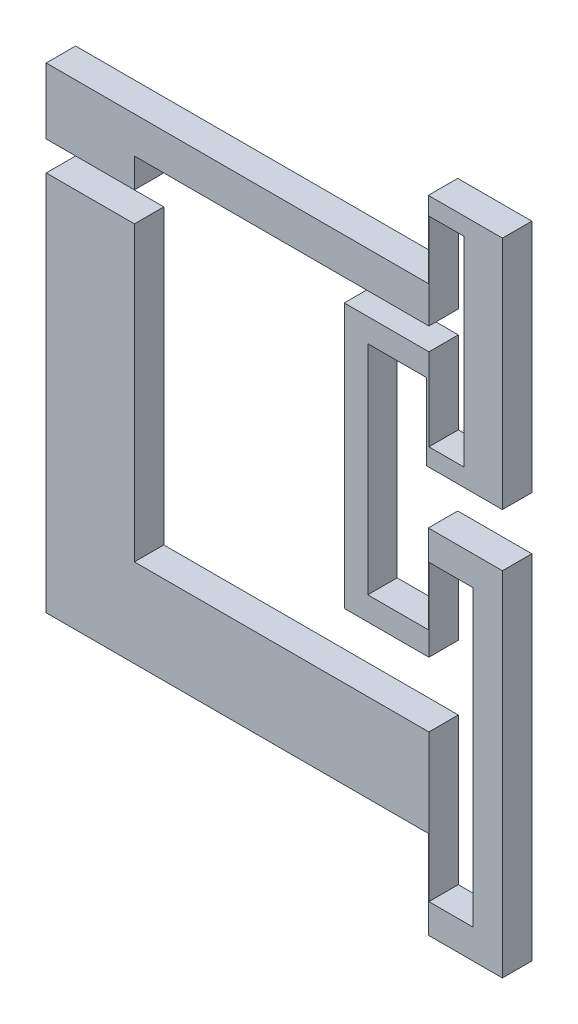
ISO-10303-21;
HEADER;
FILE_DESCRIPTION(('STEP AP214'),'2;1');
FILE_NAME('part.step','',(''),(''),'','','');
FILE_SCHEMA(('AUTOMOTIVE_DESIGN { 1 0 10303 214 1 1 1 1 }'));
ENDSEC;
DATA;
#1=APPLICATION_CONTEXT('core data for automotive mechanical design processes');
#2=APPLICATION_PROTOCOL_DEFINITION('international standard','automotive_design',2000,#1);
#3=PRODUCT_CONTEXT('',#1,'mechanical');
#4=PRODUCT('Part','Part','',(#3));
#5=PRODUCT_RELATED_PRODUCT_CATEGORY('part','',(#4));
#6=PRODUCT_DEFINITION_FORMATION('','',#4);
#7=PRODUCT_DEFINITION_CONTEXT('part definition',#1,'design');
#8=PRODUCT_DEFINITION('design','',#6,#7);
#9=PRODUCT_DEFINITION_SHAPE('','',#8);
#10=(LENGTH_UNIT() NAMED_UNIT(*) SI_UNIT(.MILLI.,.METRE.));
#11=(NAMED_UNIT(*) PLANE_ANGLE_UNIT() SI_UNIT($,.RADIAN.));
#12=(NAMED_UNIT(*) SI_UNIT($,.STERADIAN.) SOLID_ANGLE_UNIT());
#13=UNCERTAINTY_MEASURE_WITH_UNIT(LENGTH_MEASURE(1.E-05),#10,'distance_accuracy_value','');
#14=(GEOMETRIC_REPRESENTATION_CONTEXT(3) GLOBAL_UNCERTAINTY_ASSIGNED_CONTEXT((#13)) GLOBAL_UNIT_ASSIGNED_CONTEXT((#10,
#11,#12)) REPRESENTATION_CONTEXT('',''));
#15=CARTESIAN_POINT('',(0.,0.,0.));
#16=DIRECTION('',(0.,0.,1.));
#17=DIRECTION('',(1.,0.,0.));
#18=AXIS2_PLACEMENT_3D('',#15,#16,#17);
#19=CARTESIAN_POINT('',(0.,0.,5.));
#20=DIRECTION('',(0.,1.,0.));
#21=DIRECTION('',(0.,0.,1.));
#22=AXIS2_PLACEMENT_3D('',#19,#20,#21);
#23=PLANE('',#22);
#24=DIRECTION('',(1.,0.,0.));
#25=VECTOR('',#24,1.);
#26=CARTESIAN_POINT('',(0.,0.,0.));
#27=LINE('',#26,#25);
#28=CARTESIAN_POINT('',(0.,0.,0.));
#29=VERTEX_POINT('',#28);
#30=CARTESIAN_POINT('',(65.,0.,0.));
#31=VERTEX_POINT('',#30);
#32=EDGE_CURVE('E302',#29,#31,#27,.T.);
#33=ORIENTED_EDGE('',*,*,#32,.T.);
#34=DIRECTION('',(0.,0.,-1.));
#35=VECTOR('',#34,1.);
#36=CARTESIAN_POINT('',(65.,0.,5.));
#37=LINE('',#36,#35);
#38=CARTESIAN_POINT('',(65.,0.,5.));
#39=VERTEX_POINT('',#38);
#40=EDGE_CURVE('E11',#39,#31,#37,.T.);
#41=ORIENTED_EDGE('',*,*,#40,.F.);
#42=DIRECTION('',(1.,0.,0.));
#43=VECTOR('',#42,1.);
#44=CARTESIAN_POINT('',(0.,0.,5.));
#45=LINE('',#44,#43);
#46=CARTESIAN_POINT('',(0.,0.,5.));
#47=VERTEX_POINT('',#46);
#48=EDGE_CURVE('E375',#47,#39,#45,.T.);
#49=ORIENTED_EDGE('',*,*,#48,.F.);
#50=DIRECTION('',(0.,0.,-1.));
#51=VECTOR('',#50,1.);
#52=CARTESIAN_POINT('',(0.,0.,5.));
#53=LINE('',#52,#51);
#54=EDGE_CURVE('E298',#47,#29,#53,.T.);
#55=ORIENTED_EDGE('',*,*,#54,.T.);
#56=EDGE_LOOP('',(#33,#41,#49,#55));
#57=FACE_BOUND('',#56,.T.);
#58=ADVANCED_FACE('F38',(#57),#23,.F.);
#59=CARTESIAN_POINT('',(65.,-15.,5.));
#60=DIRECTION('',(1.,0.,0.));
#61=DIRECTION('',(0.,0.,-1.));
#62=AXIS2_PLACEMENT_3D('',#59,#60,#61);
#63=PLANE('',#62);
#64=DIRECTION('',(0.,-1.,0.));
#65=VECTOR('',#64,1.);
#66=CARTESIAN_POINT('',(65.,-15.,0.));
#67=LINE('',#66,#65);
#68=CARTESIAN_POINT('',(65.,-15.,0.));
#69=VERTEX_POINT('',#68);
#70=EDGE_CURVE('E305',#31,#69,#67,.T.);
#71=ORIENTED_EDGE('',*,*,#70,.T.);
#72=DIRECTION('',(0.,0.,-1.));
#73=VECTOR('',#72,1.);
#74=CARTESIAN_POINT('',(65.,-15.,5.));
#75=LINE('',#74,#73);
#76=CARTESIAN_POINT('',(65.,-15.,5.));
#77=VERTEX_POINT('',#76);
#78=EDGE_CURVE('E46',#77,#69,#75,.T.);
#79=ORIENTED_EDGE('',*,*,#78,.F.);
#80=DIRECTION('',(0.,-1.,0.));
#81=VECTOR('',#80,1.);
#82=CARTESIAN_POINT('',(65.,-10.,5.));
#83=LINE('',#82,#81);
#84=EDGE_CURVE('E181',#39,#77,#83,.T.);
#85=ORIENTED_EDGE('',*,*,#84,.F.);
#86=ORIENTED_EDGE('',*,*,#40,.T.);
#87=EDGE_LOOP('',(#71,#79,#85,#86));
#88=FACE_BOUND('',#87,.T.);
#89=ADVANCED_FACE('F573',(#88),#63,.F.);
#90=CARTESIAN_POINT('',(77.6,-15.,5.));
#91=DIRECTION('',(0.,1.,0.));
#92=DIRECTION('',(-1.,0.,0.));
#93=AXIS2_PLACEMENT_3D('',#90,#91,#92);
#94=PLANE('',#93);
#95=DIRECTION('',(1.,0.,0.));
#96=VECTOR('',#95,1.);
#97=CARTESIAN_POINT('',(77.6,-15.,0.));
#98=LINE('',#97,#96);
#99=CARTESIAN_POINT('',(77.6,-15.,0.));
#100=VERTEX_POINT('',#99);
#101=EDGE_CURVE('E307',#69,#100,#98,.T.);
#102=ORIENTED_EDGE('',*,*,#101,.T.);
#103=DIRECTION('',(0.,0.,-1.));
#104=VECTOR('',#103,1.);
#105=CARTESIAN_POINT('',(77.6,-15.,5.));
#106=LINE('',#105,#104);
#107=CARTESIAN_POINT('',(77.6,-15.,5.));
#108=VERTEX_POINT('',#107);
#109=EDGE_CURVE('E466',#108,#100,#106,.T.);
#110=ORIENTED_EDGE('',*,*,#109,.F.);
#111=DIRECTION('',(1.,0.,0.));
#112=VECTOR('',#111,1.);
#113=CARTESIAN_POINT('',(77.6,-15.,5.));
#114=LINE('',#113,#112);
#115=EDGE_CURVE('E474',#77,#108,#114,.T.);
#116=ORIENTED_EDGE('',*,*,#115,.F.);
#117=ORIENTED_EDGE('',*,*,#78,.T.);
#118=EDGE_LOOP('',(#102,#110,#116,#117));
#119=FACE_BOUND('',#118,.T.);
#120=ADVANCED_FACE('F472',(#119),#94,.F.);
#121=CARTESIAN_POINT('',(77.6,45.,5.));
#122=DIRECTION('',(-1.,0.,0.));
#123=DIRECTION('',(0.,-1.,0.));
#124=AXIS2_PLACEMENT_3D('',#121,#122,#123);
#125=PLANE('',#124);
#126=DIRECTION('',(0.,1.,0.));
#127=VECTOR('',#126,1.);
#128=CARTESIAN_POINT('',(77.6,45.,0.));
#129=LINE('',#128,#127);
#130=CARTESIAN_POINT('',(77.6,45.,0.));
#131=VERTEX_POINT('',#130);
#132=EDGE_CURVE('E309',#100,#131,#129,.T.);
#133=ORIENTED_EDGE('',*,*,#132,.T.);
#134=DIRECTION('',(0.,0.,-1.));
#135=VECTOR('',#134,1.);
#136=CARTESIAN_POINT('',(77.6,45.,5.));
#137=LINE('',#136,#135);
#138=CARTESIAN_POINT('',(77.6,45.,5.));
#139=VERTEX_POINT('',#138);
#140=EDGE_CURVE('E463',#139,#131,#137,.T.);
#141=ORIENTED_EDGE('',*,*,#140,.F.);
#142=DIRECTION('',(0.,1.,0.));
#143=VECTOR('',#142,1.);
#144=CARTESIAN_POINT('',(77.6,45.,5.));
#145=LINE('',#144,#143);
#146=EDGE_CURVE('E492',#108,#139,#145,.T.);
#147=ORIENTED_EDGE('',*,*,#146,.F.);
#148=ORIENTED_EDGE('',*,*,#109,.T.);
#149=EDGE_LOOP('',(#133,#141,#147,#148));
#150=FACE_BOUND('',#149,.T.);
#151=ADVANCED_FACE('F483',(#150),#125,.F.);
#152=CARTESIAN_POINT('',(77.6,45.,5.));
#153=DIRECTION('',(0.,-1.,0.));
#154=DIRECTION('',(1.,0.,0.));
#155=AXIS2_PLACEMENT_3D('',#152,#153,#154);
#156=PLANE('',#155);
#157=DIRECTION('',(-1.,0.,0.));
#158=VECTOR('',#157,1.);
#159=CARTESIAN_POINT('',(77.6,45.,0.));
#160=LINE('',#159,#158);
#161=CARTESIAN_POINT('',(65.,45.,0.));
#162=VERTEX_POINT('',#161);
#163=EDGE_CURVE('E311',#131,#162,#160,.T.);
#164=ORIENTED_EDGE('',*,*,#163,.T.);
#165=DIRECTION('',(0.,0.,-1.));
#166=VECTOR('',#165,1.);
#167=CARTESIAN_POINT('',(65.,45.,5.));
#168=LINE('',#167,#166);
#169=CARTESIAN_POINT('',(65.,45.,5.));
#170=VERTEX_POINT('',#169);
#171=EDGE_CURVE('E460',#170,#162,#168,.T.);
#172=ORIENTED_EDGE('',*,*,#171,.F.);
#173=DIRECTION('',(-1.,0.,0.));
#174=VECTOR('',#173,1.);
#175=CARTESIAN_POINT('',(77.6,45.,5.));
#176=LINE('',#175,#174);
#177=EDGE_CURVE('E489',#139,#170,#176,.T.);
#178=ORIENTED_EDGE('',*,*,#177,.F.);
#179=ORIENTED_EDGE('',*,*,#140,.T.);
#180=EDGE_LOOP('',(#164,#172,#178,#179));
#181=FACE_BOUND('',#180,.T.);
#182=ADVANCED_FACE('F487',(#181),#156,.F.);
#183=CARTESIAN_POINT('',(65.,45.,5.));
#184=DIRECTION('',(1.,0.,0.));
#185=DIRECTION('',(0.,0.,-1.));
#186=AXIS2_PLACEMENT_3D('',#183,#184,#185);
#187=PLANE('',#186);
#188=DIRECTION('',(0.,-1.,0.));
#189=VECTOR('',#188,1.);
#190=CARTESIAN_POINT('',(65.,45.,0.));
#191=LINE('',#190,#189);
#192=CARTESIAN_POINT('',(65.,30.,0.));
#193=VERTEX_POINT('',#192);
#194=EDGE_CURVE('E313',#162,#193,#191,.T.);
#195=ORIENTED_EDGE('',*,*,#194,.T.);
#196=DIRECTION('',(0.,0.,-1.));
#197=VECTOR('',#196,1.);
#198=CARTESIAN_POINT('',(65.,30.,5.));
#199=LINE('',#198,#197);
#200=CARTESIAN_POINT('',(65.,30.,5.));
#201=VERTEX_POINT('',#200);
#202=EDGE_CURVE('E457',#201,#193,#199,.T.);
#203=ORIENTED_EDGE('',*,*,#202,.F.);
#204=DIRECTION('',(0.,-1.,0.));
#205=VECTOR('',#204,1.);
#206=CARTESIAN_POINT('',(65.,45.,5.));
#207=LINE('',#206,#205);
#208=EDGE_CURVE('E491',#170,#201,#207,.T.);
#209=ORIENTED_EDGE('',*,*,#208,.F.);
#210=ORIENTED_EDGE('',*,*,#171,.T.);
#211=EDGE_LOOP('',(#195,#203,#209,#210));
#212=FACE_BOUND('',#211,.T.);
#213=ADVANCED_FACE('F586',(#212),#187,.F.);
#214=CARTESIAN_POINT('',(65.,30.,5.));
#215=DIRECTION('',(0.,-1.,0.));
#216=DIRECTION('',(0.,0.,-1.));
#217=AXIS2_PLACEMENT_3D('',#214,#215,#216);
#218=PLANE('',#217);
#219=DIRECTION('',(-1.,0.,0.));
#220=VECTOR('',#219,1.);
#221=CARTESIAN_POINT('',(65.,30.,0.));
#222=LINE('',#221,#220);
#223=CARTESIAN_POINT('',(54.7,30.,0.));
#224=VERTEX_POINT('',#223);
#225=EDGE_CURVE('E315',#193,#224,#222,.T.);
#226=ORIENTED_EDGE('',*,*,#225,.T.);
#227=DIRECTION('',(0.,0.,-1.));
#228=VECTOR('',#227,1.);
#229=CARTESIAN_POINT('',(54.7,30.,5.));
#230=LINE('',#229,#228);
#231=CARTESIAN_POINT('',(54.7,30.,5.));
#232=VERTEX_POINT('',#231);
#233=EDGE_CURVE('E454',#232,#224,#230,.T.);
#234=ORIENTED_EDGE('',*,*,#233,.F.);
#235=DIRECTION('',(-1.,0.,0.));
#236=VECTOR('',#235,1.);
#237=CARTESIAN_POINT('',(65.,30.,5.));
#238=LINE('',#237,#236);
#239=EDGE_CURVE('E494',#201,#232,#238,.T.);
#240=ORIENTED_EDGE('',*,*,#239,.F.);
#241=ORIENTED_EDGE('',*,*,#202,.T.);
#242=EDGE_LOOP('',(#226,#234,#240,#241));
#243=FACE_BOUND('',#242,.T.);
#244=ADVANCED_FACE('F589',(#243),#218,.F.);
#245=CARTESIAN_POINT('',(54.7,67.,5.));
#246=DIRECTION('',(-1.,0.,0.));
#247=DIRECTION('',(0.,-1.,0.));
#248=AXIS2_PLACEMENT_3D('',#245,#246,#247);
#249=PLANE('',#248);
#250=DIRECTION('',(0.,1.,0.));
#251=VECTOR('',#250,1.);
#252=CARTESIAN_POINT('',(54.7,67.,0.));
#253=LINE('',#252,#251);
#254=CARTESIAN_POINT('',(54.7,67.,0.));
#255=VERTEX_POINT('',#254);
#256=EDGE_CURVE('E317',#224,#255,#253,.T.);
#257=ORIENTED_EDGE('',*,*,#256,.T.);
#258=DIRECTION('',(0.,0.,-1.));
#259=VECTOR('',#258,1.);
#260=CARTESIAN_POINT('',(54.7,67.,5.));
#261=LINE('',#260,#259);
#262=CARTESIAN_POINT('',(54.7,67.,5.));
#263=VERTEX_POINT('',#262);
#264=EDGE_CURVE('E451',#263,#255,#261,.T.);
#265=ORIENTED_EDGE('',*,*,#264,.F.);
#266=DIRECTION('',(0.,1.,0.));
#267=VECTOR('',#266,1.);
#268=CARTESIAN_POINT('',(54.7,67.,5.));
#269=LINE('',#268,#267);
#270=EDGE_CURVE('E500',#232,#263,#269,.T.);
#271=ORIENTED_EDGE('',*,*,#270,.F.);
#272=ORIENTED_EDGE('',*,*,#233,.T.);
#273=EDGE_LOOP('',(#257,#265,#271,#272));
#274=FACE_BOUND('',#273,.T.);
#275=ADVANCED_FACE('F593',(#274),#249,.F.);
#276=CARTESIAN_POINT('',(54.7,67.,5.));
#277=DIRECTION('',(0.,1.,0.));
#278=DIRECTION('',(0.,0.,1.));
#279=AXIS2_PLACEMENT_3D('',#276,#277,#278);
#280=PLANE('',#279);
#281=DIRECTION('',(1.,0.,0.));
#282=VECTOR('',#281,1.);
#283=CARTESIAN_POINT('',(54.7,67.,0.));
#284=LINE('',#283,#282);
#285=CARTESIAN_POINT('',(64.7,67.,0.));
#286=VERTEX_POINT('',#285);
#287=EDGE_CURVE('E319',#255,#286,#284,.T.);
#288=ORIENTED_EDGE('',*,*,#287,.T.);
#289=DIRECTION('',(0.,0.,-1.));
#290=VECTOR('',#289,1.);
#291=CARTESIAN_POINT('',(64.7,67.,5.));
#292=LINE('',#291,#290);
#293=CARTESIAN_POINT('',(64.7,67.,5.));
#294=VERTEX_POINT('',#293);
#295=EDGE_CURVE('E448',#294,#286,#292,.T.);
#296=ORIENTED_EDGE('',*,*,#295,.F.);
#297=DIRECTION('',(1.,0.,0.));
#298=VECTOR('',#297,1.);
#299=CARTESIAN_POINT('',(54.7,67.,5.));
#300=LINE('',#299,#298);
#301=EDGE_CURVE('E502',#263,#294,#300,.T.);
#302=ORIENTED_EDGE('',*,*,#301,.F.);
#303=ORIENTED_EDGE('',*,*,#264,.T.);
#304=EDGE_LOOP('',(#288,#296,#302,#303));
#305=FACE_BOUND('',#304,.T.);
#306=ADVANCED_FACE('F597',(#305),#280,.F.);
#307=CARTESIAN_POINT('',(64.7,54.,5.));
#308=DIRECTION('',(1.,0.,0.));
#309=DIRECTION('',(0.,0.,-1.));
#310=AXIS2_PLACEMENT_3D('',#307,#308,#309);
#311=PLANE('',#310);
#312=DIRECTION('',(0.,-1.,0.));
#313=VECTOR('',#312,1.);
#314=CARTESIAN_POINT('',(64.7,54.,0.));
#315=LINE('',#314,#313);
#316=CARTESIAN_POINT('',(64.7,54.,0.));
#317=VERTEX_POINT('',#316);
#318=EDGE_CURVE('E321',#286,#317,#315,.T.);
#319=ORIENTED_EDGE('',*,*,#318,.T.);
#320=DIRECTION('',(0.,0.,-1.));
#321=VECTOR('',#320,1.);
#322=CARTESIAN_POINT('',(64.7,54.,5.));
#323=LINE('',#322,#321);
#324=CARTESIAN_POINT('',(64.7,54.,5.));
#325=VERTEX_POINT('',#324);
#326=EDGE_CURVE('E445',#325,#317,#323,.T.);
#327=ORIENTED_EDGE('',*,*,#326,.F.);
#328=DIRECTION('',(0.,-1.,0.));
#329=VECTOR('',#328,1.);
#330=CARTESIAN_POINT('',(64.7,54.,5.));
#331=LINE('',#330,#329);
#332=EDGE_CURVE('E504',#294,#325,#331,.T.);
#333=ORIENTED_EDGE('',*,*,#332,.F.);
#334=ORIENTED_EDGE('',*,*,#295,.T.);
#335=EDGE_LOOP('',(#319,#327,#333,#334));
#336=FACE_BOUND('',#335,.T.);
#337=ADVANCED_FACE('F601',(#336),#311,.F.);
#338=CARTESIAN_POINT('',(77.6,54.,5.));
#339=DIRECTION('',(0.,1.,0.));
#340=DIRECTION('',(0.,0.,1.));
#341=AXIS2_PLACEMENT_3D('',#338,#339,#340);
#342=PLANE('',#341);
#343=DIRECTION('',(1.,0.,0.));
#344=VECTOR('',#343,1.);
#345=CARTESIAN_POINT('',(77.6,54.,0.));
#346=LINE('',#345,#344);
#347=CARTESIAN_POINT('',(77.6,54.,0.));
#348=VERTEX_POINT('',#347);
#349=EDGE_CURVE('E323',#317,#348,#346,.T.);
#350=ORIENTED_EDGE('',*,*,#349,.T.);
#351=DIRECTION('',(0.,0.,-1.));
#352=VECTOR('',#351,1.);
#353=CARTESIAN_POINT('',(77.6,54.,5.));
#354=LINE('',#353,#352);
#355=CARTESIAN_POINT('',(77.6,54.,5.));
#356=VERTEX_POINT('',#355);
#357=EDGE_CURVE('E442',#356,#348,#354,.T.);
#358=ORIENTED_EDGE('',*,*,#357,.F.);
#359=DIRECTION('',(1.,0.,0.));
#360=VECTOR('',#359,1.);
#361=CARTESIAN_POINT('',(77.6,54.,5.));
#362=LINE('',#361,#360);
#363=EDGE_CURVE('E506',#325,#356,#362,.T.);
#364=ORIENTED_EDGE('',*,*,#363,.F.);
#365=ORIENTED_EDGE('',*,*,#326,.T.);
#366=EDGE_LOOP('',(#350,#358,#364,#365));
#367=FACE_BOUND('',#366,.T.);
#368=ADVANCED_FACE('F605',(#367),#342,.F.);
#369=CARTESIAN_POINT('',(77.6,94.,5.));
#370=DIRECTION('',(-1.,0.,0.));
#371=DIRECTION('',(0.,0.,1.));
#372=AXIS2_PLACEMENT_3D('',#369,#370,#371);
#373=PLANE('',#372);
#374=DIRECTION('',(0.,1.,0.));
#375=VECTOR('',#374,1.);
#376=CARTESIAN_POINT('',(77.6,94.,0.));
#377=LINE('',#376,#375);
#378=CARTESIAN_POINT('',(77.6,94.,0.));
#379=VERTEX_POINT('',#378);
#380=EDGE_CURVE('E325',#348,#379,#377,.T.);
#381=ORIENTED_EDGE('',*,*,#380,.T.);
#382=DIRECTION('',(0.,0.,-1.));
#383=VECTOR('',#382,1.);
#384=CARTESIAN_POINT('',(77.6,94.,5.));
#385=LINE('',#384,#383);
#386=CARTESIAN_POINT('',(77.6,94.,5.));
#387=VERTEX_POINT('',#386);
#388=EDGE_CURVE('E439',#387,#379,#385,.T.);
#389=ORIENTED_EDGE('',*,*,#388,.F.);
#390=DIRECTION('',(0.,1.,0.));
#391=VECTOR('',#390,1.);
#392=CARTESIAN_POINT('',(77.6,94.,5.));
#393=LINE('',#392,#391);
#394=EDGE_CURVE('E508',#356,#387,#393,.T.);
#395=ORIENTED_EDGE('',*,*,#394,.F.);
#396=ORIENTED_EDGE('',*,*,#357,.T.);
#397=EDGE_LOOP('',(#381,#389,#395,#396));
#398=FACE_BOUND('',#397,.T.);
#399=ADVANCED_FACE('F609',(#398),#373,.F.);
#400=CARTESIAN_POINT('',(65.,94.,5.));
#401=DIRECTION('',(0.,-1.,0.));
#402=DIRECTION('',(0.,0.,-1.));
#403=AXIS2_PLACEMENT_3D('',#400,#401,#402);
#404=PLANE('',#403);
#405=DIRECTION('',(-1.,0.,0.));
#406=VECTOR('',#405,1.);
#407=CARTESIAN_POINT('',(65.,94.,0.));
#408=LINE('',#407,#406);
#409=CARTESIAN_POINT('',(65.,94.,0.));
#410=VERTEX_POINT('',#409);
#411=EDGE_CURVE('E327',#379,#410,#408,.T.);
#412=ORIENTED_EDGE('',*,*,#411,.T.);
#413=DIRECTION('',(0.,0.,-1.));
#414=VECTOR('',#413,1.);
#415=CARTESIAN_POINT('',(65.,94.,5.));
#416=LINE('',#415,#414);
#417=CARTESIAN_POINT('',(65.,94.,5.));
#418=VERTEX_POINT('',#417);
#419=EDGE_CURVE('E436',#418,#410,#416,.T.);
#420=ORIENTED_EDGE('',*,*,#419,.F.);
#421=DIRECTION('',(-1.,0.,0.));
#422=VECTOR('',#421,1.);
#423=CARTESIAN_POINT('',(65.,94.,5.));
#424=LINE('',#423,#422);
#425=EDGE_CURVE('E510',#387,#418,#424,.T.);
#426=ORIENTED_EDGE('',*,*,#425,.F.);
#427=ORIENTED_EDGE('',*,*,#388,.T.);
#428=EDGE_LOOP('',(#412,#420,#426,#427));
#429=FACE_BOUND('',#428,.T.);
#430=ADVANCED_FACE('F613',(#429),#404,.F.);
#431=CARTESIAN_POINT('',(65.,81.,5.));
#432=DIRECTION('',(1.,0.,0.));
#433=DIRECTION('',(0.,0.,-1.));
#434=AXIS2_PLACEMENT_3D('',#431,#432,#433);
#435=PLANE('',#434);
#436=DIRECTION('',(0.,-1.,0.));
#437=VECTOR('',#436,1.);
#438=CARTESIAN_POINT('',(65.,81.,0.));
#439=LINE('',#438,#437);
#440=CARTESIAN_POINT('',(65.,81.,0.));
#441=VERTEX_POINT('',#440);
#442=EDGE_CURVE('E329',#410,#441,#439,.T.);
#443=ORIENTED_EDGE('',*,*,#442,.T.);
#444=DIRECTION('',(0.,0.,-1.));
#445=VECTOR('',#444,1.);
#446=CARTESIAN_POINT('',(65.,81.,5.));
#447=LINE('',#446,#445);
#448=CARTESIAN_POINT('',(65.,81.,5.));
#449=VERTEX_POINT('',#448);
#450=EDGE_CURVE('E433',#449,#441,#447,.T.);
#451=ORIENTED_EDGE('',*,*,#450,.F.);
#452=DIRECTION('',(0.,-1.,0.));
#453=VECTOR('',#452,1.);
#454=CARTESIAN_POINT('',(65.,81.,5.));
#455=LINE('',#454,#453);
#456=EDGE_CURVE('E512',#418,#449,#455,.T.);
#457=ORIENTED_EDGE('',*,*,#456,.F.);
#458=ORIENTED_EDGE('',*,*,#419,.T.);
#459=EDGE_LOOP('',(#443,#451,#457,#458));
#460=FACE_BOUND('',#459,.T.);
#461=ADVANCED_FACE('F617',(#460),#435,.F.);
#462=CARTESIAN_POINT('',(0.,81.,5.));
#463=DIRECTION('',(0.,-1.,0.));
#464=DIRECTION('',(0.,0.,-1.));
#465=AXIS2_PLACEMENT_3D('',#462,#463,#464);
#466=PLANE('',#465);
#467=DIRECTION('',(-1.,0.,0.));
#468=VECTOR('',#467,1.);
#469=CARTESIAN_POINT('',(0.,81.,0.));
#470=LINE('',#469,#468);
#471=CARTESIAN_POINT('',(0.,81.,0.));
#472=VERTEX_POINT('',#471);
#473=EDGE_CURVE('E331',#441,#472,#470,.T.);
#474=ORIENTED_EDGE('',*,*,#473,.T.);
#475=DIRECTION('',(0.,0.,-1.));
#476=VECTOR('',#475,1.);
#477=CARTESIAN_POINT('',(0.,81.,5.));
#478=LINE('',#477,#476);
#479=CARTESIAN_POINT('',(0.,81.,5.));
#480=VERTEX_POINT('',#479);
#481=EDGE_CURVE('E430',#480,#472,#478,.T.);
#482=ORIENTED_EDGE('',*,*,#481,.F.);
#483=DIRECTION('',(-1.,0.,0.));
#484=VECTOR('',#483,1.);
#485=CARTESIAN_POINT('',(0.,81.,5.));
#486=LINE('',#485,#484);
#487=EDGE_CURVE('E514',#449,#480,#486,.T.);
#488=ORIENTED_EDGE('',*,*,#487,.F.);
#489=ORIENTED_EDGE('',*,*,#450,.T.);
#490=EDGE_LOOP('',(#474,#482,#488,#489));
#491=FACE_BOUND('',#490,.T.);
#492=ADVANCED_FACE('F621',(#491),#466,.F.);
#493=CARTESIAN_POINT('',(0.,69.8,5.));
#494=DIRECTION('',(1.,0.,0.));
#495=DIRECTION('',(0.,0.,-1.));
#496=AXIS2_PLACEMENT_3D('',#493,#494,#495);
#497=PLANE('',#496);
#498=DIRECTION('',(0.,-1.,0.));
#499=VECTOR('',#498,1.);
#500=CARTESIAN_POINT('',(0.,69.8,0.));
#501=LINE('',#500,#499);
#502=CARTESIAN_POINT('',(0.,69.8,0.));
#503=VERTEX_POINT('',#502);
#504=EDGE_CURVE('E333',#472,#503,#501,.T.);
#505=ORIENTED_EDGE('',*,*,#504,.T.);
#506=DIRECTION('',(0.,0.,-1.));
#507=VECTOR('',#506,1.);
#508=CARTESIAN_POINT('',(0.,69.8,5.));
#509=LINE('',#508,#507);
#510=CARTESIAN_POINT('',(0.,69.8,5.));
#511=VERTEX_POINT('',#510);
#512=EDGE_CURVE('E427',#511,#503,#509,.T.);
#513=ORIENTED_EDGE('',*,*,#512,.F.);
#514=DIRECTION('',(0.,-1.,0.));
#515=VECTOR('',#514,1.);
#516=CARTESIAN_POINT('',(0.,69.8,5.));
#517=LINE('',#516,#515);
#518=EDGE_CURVE('E516',#480,#511,#517,.T.);
#519=ORIENTED_EDGE('',*,*,#518,.F.);
#520=ORIENTED_EDGE('',*,*,#481,.T.);
#521=EDGE_LOOP('',(#505,#513,#519,#520));
#522=FACE_BOUND('',#521,.T.);
#523=ADVANCED_FACE('F625',(#522),#497,.F.);
#524=CARTESIAN_POINT('',(15.,69.8,5.));
#525=DIRECTION('',(0.,1.,0.));
#526=DIRECTION('',(0.,0.,1.));
#527=AXIS2_PLACEMENT_3D('',#524,#525,#526);
#528=PLANE('',#527);
#529=DIRECTION('',(1.,0.,0.));
#530=VECTOR('',#529,1.);
#531=CARTESIAN_POINT('',(15.,69.8,0.));
#532=LINE('',#531,#530);
#533=CARTESIAN_POINT('',(15.,69.8,0.));
#534=VERTEX_POINT('',#533);
#535=EDGE_CURVE('E335',#503,#534,#532,.T.);
#536=ORIENTED_EDGE('',*,*,#535,.T.);
#537=DIRECTION('',(0.,0.,-1.));
#538=VECTOR('',#537,1.);
#539=CARTESIAN_POINT('',(15.,69.8,5.));
#540=LINE('',#539,#538);
#541=CARTESIAN_POINT('',(15.,69.8,5.));
#542=VERTEX_POINT('',#541);
#543=EDGE_CURVE('E424',#542,#534,#540,.T.);
#544=ORIENTED_EDGE('',*,*,#543,.F.);
#545=DIRECTION('',(1.,0.,0.));
#546=VECTOR('',#545,1.);
#547=CARTESIAN_POINT('',(15.,69.8,5.));
#548=LINE('',#547,#546);
#549=EDGE_CURVE('E518',#511,#542,#548,.T.);
#550=ORIENTED_EDGE('',*,*,#549,.F.);
#551=ORIENTED_EDGE('',*,*,#512,.T.);
#552=EDGE_LOOP('',(#536,#544,#550,#551));
#553=FACE_BOUND('',#552,.T.);
#554=ADVANCED_FACE('F629',(#553),#528,.F.);
#555=CARTESIAN_POINT('',(15.,74.8,5.));
#556=DIRECTION('',(-1.,0.,0.));
#557=DIRECTION('',(0.,0.,1.));
#558=AXIS2_PLACEMENT_3D('',#555,#556,#557);
#559=PLANE('',#558);
#560=DIRECTION('',(0.,1.,0.));
#561=VECTOR('',#560,1.);
#562=CARTESIAN_POINT('',(15.,74.8,0.));
#563=LINE('',#562,#561);
#564=CARTESIAN_POINT('',(15.,74.8,0.));
#565=VERTEX_POINT('',#564);
#566=EDGE_CURVE('E337',#534,#565,#563,.T.);
#567=ORIENTED_EDGE('',*,*,#566,.T.);
#568=DIRECTION('',(0.,0.,-1.));
#569=VECTOR('',#568,1.);
#570=CARTESIAN_POINT('',(15.,74.8,5.));
#571=LINE('',#570,#569);
#572=CARTESIAN_POINT('',(15.,74.8,5.));
#573=VERTEX_POINT('',#572);
#574=EDGE_CURVE('E421',#573,#565,#571,.T.);
#575=ORIENTED_EDGE('',*,*,#574,.F.);
#576=DIRECTION('',(0.,1.,0.));
#577=VECTOR('',#576,1.);
#578=CARTESIAN_POINT('',(15.,74.8,5.));
#579=LINE('',#578,#577);
#580=EDGE_CURVE('E520',#542,#573,#579,.T.);
#581=ORIENTED_EDGE('',*,*,#580,.F.);
#582=ORIENTED_EDGE('',*,*,#543,.T.);
#583=EDGE_LOOP('',(#567,#575,#581,#582));
#584=FACE_BOUND('',#583,.T.);
#585=ADVANCED_FACE('F633',(#584),#559,.F.);
#586=CARTESIAN_POINT('',(65.1,74.8,5.));
#587=DIRECTION('',(0.,1.,0.));
#588=DIRECTION('',(-1.,0.,0.));
#589=AXIS2_PLACEMENT_3D('',#586,#587,#588);
#590=PLANE('',#589);
#591=DIRECTION('',(1.,0.,0.));
#592=VECTOR('',#591,1.);
#593=CARTESIAN_POINT('',(65.1,74.8,0.));
#594=LINE('',#593,#592);
#595=CARTESIAN_POINT('',(65.1,74.8,0.));
#596=VERTEX_POINT('',#595);
#597=EDGE_CURVE('E339',#565,#596,#594,.T.);
#598=ORIENTED_EDGE('',*,*,#597,.T.);
#599=DIRECTION('',(0.,0.,-1.));
#600=VECTOR('',#599,1.);
#601=CARTESIAN_POINT('',(65.1,74.8,5.));
#602=LINE('',#601,#600);
#603=CARTESIAN_POINT('',(65.1,74.8,5.));
#604=VERTEX_POINT('',#603);
#605=EDGE_CURVE('E418',#604,#596,#602,.T.);
#606=ORIENTED_EDGE('',*,*,#605,.F.);
#607=DIRECTION('',(1.,0.,0.));
#608=VECTOR('',#607,1.);
#609=CARTESIAN_POINT('',(65.1,74.8,5.));
#610=LINE('',#609,#608);
#611=EDGE_CURVE('E522',#573,#604,#610,.T.);
#612=ORIENTED_EDGE('',*,*,#611,.F.);
#613=ORIENTED_EDGE('',*,*,#574,.T.);
#614=EDGE_LOOP('',(#598,#606,#612,#613));
#615=FACE_BOUND('',#614,.T.);
#616=ADVANCED_FACE('F637',(#615),#590,.F.);
#617=CARTESIAN_POINT('',(65.1,81.,5.));
#618=DIRECTION('',(-1.,0.,0.));
#619=DIRECTION('',(0.,0.,1.));
#620=AXIS2_PLACEMENT_3D('',#617,#618,#619);
#621=PLANE('',#620);
#622=DIRECTION('',(0.,1.,0.));
#623=VECTOR('',#622,1.);
#624=CARTESIAN_POINT('',(65.1,81.,0.));
#625=LINE('',#624,#623);
#626=CARTESIAN_POINT('',(65.1,91.,0.));
#627=VERTEX_POINT('',#626);
#628=EDGE_CURVE('E342',#596,#627,#625,.T.);
#629=ORIENTED_EDGE('',*,*,#628,.T.);
#630=DIRECTION('',(0.,0.,-1.));
#631=VECTOR('',#630,1.);
#632=CARTESIAN_POINT('',(65.1,91.,5.));
#633=LINE('',#632,#631);
#634=CARTESIAN_POINT('',(65.1,91.,5.));
#635=VERTEX_POINT('',#634);
#636=EDGE_CURVE('E415',#635,#627,#633,.T.);
#637=ORIENTED_EDGE('',*,*,#636,.F.);
#638=DIRECTION('',(0.,1.,0.));
#639=VECTOR('',#638,1.);
#640=CARTESIAN_POINT('',(65.1,81.,5.));
#641=LINE('',#640,#639);
#642=EDGE_CURVE('E524',#604,#635,#641,.T.);
#643=ORIENTED_EDGE('',*,*,#642,.F.);
#644=ORIENTED_EDGE('',*,*,#605,.T.);
#645=EDGE_LOOP('',(#629,#637,#643,#644));
#646=FACE_BOUND('',#645,.T.);
#647=ADVANCED_FACE('F641',(#646),#621,.F.);
#648=CARTESIAN_POINT('',(71.1,91.,5.));
#649=DIRECTION('',(0.,1.,0.));
#650=DIRECTION('',(-1.,0.,0.));
#651=AXIS2_PLACEMENT_3D('',#648,#649,#650);
#652=PLANE('',#651);
#653=DIRECTION('',(1.,0.,0.));
#654=VECTOR('',#653,1.);
#655=CARTESIAN_POINT('',(71.1,91.,0.));
#656=LINE('',#655,#654);
#657=CARTESIAN_POINT('',(71.1,91.,0.));
#658=VERTEX_POINT('',#657);
#659=EDGE_CURVE('E344',#627,#658,#656,.T.);
#660=ORIENTED_EDGE('',*,*,#659,.T.);
#661=DIRECTION('',(0.,0.,-1.));
#662=VECTOR('',#661,1.);
#663=CARTESIAN_POINT('',(71.1,91.,5.));
#664=LINE('',#663,#662);
#665=CARTESIAN_POINT('',(71.1,91.,5.));
#666=VERTEX_POINT('',#665);
#667=EDGE_CURVE('E412',#666,#658,#664,.T.);
#668=ORIENTED_EDGE('',*,*,#667,.F.);
#669=DIRECTION('',(1.,0.,0.));
#670=VECTOR('',#669,1.);
#671=CARTESIAN_POINT('',(71.1,91.,5.));
#672=LINE('',#671,#670);
#673=EDGE_CURVE('E526',#635,#666,#672,.T.);
#674=ORIENTED_EDGE('',*,*,#673,.F.);
#675=ORIENTED_EDGE('',*,*,#636,.T.);
#676=EDGE_LOOP('',(#660,#668,#674,#675));
#677=FACE_BOUND('',#676,.T.);
#678=ADVANCED_FACE('F645',(#677),#652,.F.);
#679=CARTESIAN_POINT('',(71.1,91.,5.));
#680=DIRECTION('',(1.,0.,0.));
#681=DIRECTION('',(0.,1.,0.));
#682=AXIS2_PLACEMENT_3D('',#679,#680,#681);
#683=PLANE('',#682);
#684=DIRECTION('',(0.,-1.,0.));
#685=VECTOR('',#684,1.);
#686=CARTESIAN_POINT('',(71.1,91.,0.));
#687=LINE('',#686,#685);
#688=CARTESIAN_POINT('',(71.1,57.,0.));
#689=VERTEX_POINT('',#688);
#690=EDGE_CURVE('E346',#658,#689,#687,.T.);
#691=ORIENTED_EDGE('',*,*,#690,.T.);
#692=DIRECTION('',(0.,0.,-1.));
#693=VECTOR('',#692,1.);
#694=CARTESIAN_POINT('',(71.1,57.,5.));
#695=LINE('',#694,#693);
#696=CARTESIAN_POINT('',(71.1,57.,5.));
#697=VERTEX_POINT('',#696);
#698=EDGE_CURVE('E409',#697,#689,#695,.T.);
#699=ORIENTED_EDGE('',*,*,#698,.F.);
#700=DIRECTION('',(0.,-1.,0.));
#701=VECTOR('',#700,1.);
#702=CARTESIAN_POINT('',(71.1,91.,5.));
#703=LINE('',#702,#701);
#704=EDGE_CURVE('E528',#666,#697,#703,.T.);
#705=ORIENTED_EDGE('',*,*,#704,.F.);
#706=ORIENTED_EDGE('',*,*,#667,.T.);
#707=EDGE_LOOP('',(#691,#699,#705,#706));
#708=FACE_BOUND('',#707,.T.);
#709=ADVANCED_FACE('F649',(#708),#683,.F.);
#710=CARTESIAN_POINT('',(65.1,57.,5.));
#711=DIRECTION('',(0.,-1.,0.));
#712=DIRECTION('',(0.,0.,-1.));
#713=AXIS2_PLACEMENT_3D('',#710,#711,#712);
#714=PLANE('',#713);
#715=DIRECTION('',(-1.,0.,0.));
#716=VECTOR('',#715,1.);
#717=CARTESIAN_POINT('',(65.1,57.,0.));
#718=LINE('',#717,#716);
#719=CARTESIAN_POINT('',(65.1,57.,0.));
#720=VERTEX_POINT('',#719);
#721=EDGE_CURVE('E348',#689,#720,#718,.T.);
#722=ORIENTED_EDGE('',*,*,#721,.T.);
#723=DIRECTION('',(0.,0.,-1.));
#724=VECTOR('',#723,1.);
#725=CARTESIAN_POINT('',(65.1,57.,5.));
#726=LINE('',#725,#724);
#727=CARTESIAN_POINT('',(65.1,57.,5.));
#728=VERTEX_POINT('',#727);
#729=EDGE_CURVE('E406',#728,#720,#726,.T.);
#730=ORIENTED_EDGE('',*,*,#729,.F.);
#731=DIRECTION('',(-1.,0.,0.));
#732=VECTOR('',#731,1.);
#733=CARTESIAN_POINT('',(65.1,57.,5.));
#734=LINE('',#733,#732);
#735=EDGE_CURVE('E530',#697,#728,#734,.T.);
#736=ORIENTED_EDGE('',*,*,#735,.F.);
#737=ORIENTED_EDGE('',*,*,#698,.T.);
#738=EDGE_LOOP('',(#722,#730,#736,#737));
#739=FACE_BOUND('',#738,.T.);
#740=ADVANCED_FACE('F653',(#739),#714,.F.);
#741=CARTESIAN_POINT('',(65.1,71.,5.));
#742=DIRECTION('',(-1.,0.,0.));
#743=DIRECTION('',(0.,0.,1.));
#744=AXIS2_PLACEMENT_3D('',#741,#742,#743);
#745=PLANE('',#744);
#746=DIRECTION('',(0.,1.,0.));
#747=VECTOR('',#746,1.);
#748=CARTESIAN_POINT('',(65.1,71.,0.));
#749=LINE('',#748,#747);
#750=CARTESIAN_POINT('',(65.1,71.,0.));
#751=VERTEX_POINT('',#750);
#752=EDGE_CURVE('E351',#720,#751,#749,.T.);
#753=ORIENTED_EDGE('',*,*,#752,.T.);
#754=DIRECTION('',(0.,0.,-1.));
#755=VECTOR('',#754,1.);
#756=CARTESIAN_POINT('',(65.1,71.,5.));
#757=LINE('',#756,#755);
#758=CARTESIAN_POINT('',(65.1,71.,5.));
#759=VERTEX_POINT('',#758);
#760=EDGE_CURVE('E403',#759,#751,#757,.T.);
#761=ORIENTED_EDGE('',*,*,#760,.F.);
#762=DIRECTION('',(0.,1.,0.));
#763=VECTOR('',#762,1.);
#764=CARTESIAN_POINT('',(65.1,67.,5.));
#765=LINE('',#764,#763);
#766=EDGE_CURVE('E532',#728,#759,#765,.T.);
#767=ORIENTED_EDGE('',*,*,#766,.F.);
#768=ORIENTED_EDGE('',*,*,#729,.T.);
#769=EDGE_LOOP('',(#753,#761,#767,#768));
#770=FACE_BOUND('',#769,.T.);
#771=ADVANCED_FACE('F657',(#770),#745,.F.);
#772=CARTESIAN_POINT('',(50.7,71.,5.));
#773=DIRECTION('',(0.,-1.,0.));
#774=DIRECTION('',(0.,0.,-1.));
#775=AXIS2_PLACEMENT_3D('',#772,#773,#774);
#776=PLANE('',#775);
#777=DIRECTION('',(-1.,0.,0.));
#778=VECTOR('',#777,1.);
#779=CARTESIAN_POINT('',(50.7,71.,0.));
#780=LINE('',#779,#778);
#781=CARTESIAN_POINT('',(50.7,71.,0.));
#782=VERTEX_POINT('',#781);
#783=EDGE_CURVE('E353',#751,#782,#780,.T.);
#784=ORIENTED_EDGE('',*,*,#783,.T.);
#785=DIRECTION('',(0.,0.,-1.));
#786=VECTOR('',#785,1.);
#787=CARTESIAN_POINT('',(50.7,71.,5.));
#788=LINE('',#787,#786);
#789=CARTESIAN_POINT('',(50.7,71.,5.));
#790=VERTEX_POINT('',#789);
#791=EDGE_CURVE('E400',#790,#782,#788,.T.);
#792=ORIENTED_EDGE('',*,*,#791,.F.);
#793=DIRECTION('',(-1.,0.,0.));
#794=VECTOR('',#793,1.);
#795=CARTESIAN_POINT('',(50.7,71.,5.));
#796=LINE('',#795,#794);
#797=EDGE_CURVE('E534',#759,#790,#796,.T.);
#798=ORIENTED_EDGE('',*,*,#797,.F.);
#799=ORIENTED_EDGE('',*,*,#760,.T.);
#800=EDGE_LOOP('',(#784,#792,#798,#799));
#801=FACE_BOUND('',#800,.T.);
#802=ADVANCED_FACE('F661',(#801),#776,.F.);
#803=CARTESIAN_POINT('',(50.7,26.,5.));
#804=DIRECTION('',(1.,0.,0.));
#805=DIRECTION('',(0.,0.,-1.));
#806=AXIS2_PLACEMENT_3D('',#803,#804,#805);
#807=PLANE('',#806);
#808=DIRECTION('',(0.,-1.,0.));
#809=VECTOR('',#808,1.);
#810=CARTESIAN_POINT('',(50.7,26.,0.));
#811=LINE('',#810,#809);
#812=CARTESIAN_POINT('',(50.7,26.,0.));
#813=VERTEX_POINT('',#812);
#814=EDGE_CURVE('E355',#782,#813,#811,.T.);
#815=ORIENTED_EDGE('',*,*,#814,.T.);
#816=DIRECTION('',(0.,0.,-1.));
#817=VECTOR('',#816,1.);
#818=CARTESIAN_POINT('',(50.7,26.,5.));
#819=LINE('',#818,#817);
#820=CARTESIAN_POINT('',(50.7,26.,5.));
#821=VERTEX_POINT('',#820);
#822=EDGE_CURVE('E397',#821,#813,#819,.T.);
#823=ORIENTED_EDGE('',*,*,#822,.F.);
#824=DIRECTION('',(0.,-1.,0.));
#825=VECTOR('',#824,1.);
#826=CARTESIAN_POINT('',(50.7,26.,5.));
#827=LINE('',#826,#825);
#828=EDGE_CURVE('E536',#790,#821,#827,.T.);
#829=ORIENTED_EDGE('',*,*,#828,.F.);
#830=ORIENTED_EDGE('',*,*,#791,.T.);
#831=EDGE_LOOP('',(#815,#823,#829,#830));
#832=FACE_BOUND('',#831,.T.);
#833=ADVANCED_FACE('F665',(#832),#807,.F.);
#834=CARTESIAN_POINT('',(50.7,26.,5.));
#835=DIRECTION('',(0.,1.,0.));
#836=DIRECTION('',(0.,0.,1.));
#837=AXIS2_PLACEMENT_3D('',#834,#835,#836);
#838=PLANE('',#837);
#839=DIRECTION('',(1.,0.,0.));
#840=VECTOR('',#839,1.);
#841=CARTESIAN_POINT('',(50.7,26.,0.));
#842=LINE('',#841,#840);
#843=CARTESIAN_POINT('',(65.1,26.,0.));
#844=VERTEX_POINT('',#843);
#845=EDGE_CURVE('E357',#813,#844,#842,.T.);
#846=ORIENTED_EDGE('',*,*,#845,.T.);
#847=DIRECTION('',(0.,0.,-1.));
#848=VECTOR('',#847,1.);
#849=CARTESIAN_POINT('',(65.1,26.,5.));
#850=LINE('',#849,#848);
#851=CARTESIAN_POINT('',(65.1,26.,5.));
#852=VERTEX_POINT('',#851);
#853=EDGE_CURVE('E394',#852,#844,#850,.T.);
#854=ORIENTED_EDGE('',*,*,#853,.F.);
#855=DIRECTION('',(1.,0.,0.));
#856=VECTOR('',#855,1.);
#857=CARTESIAN_POINT('',(50.7,26.,5.));
#858=LINE('',#857,#856);
#859=EDGE_CURVE('E538',#821,#852,#858,.T.);
#860=ORIENTED_EDGE('',*,*,#859,.F.);
#861=ORIENTED_EDGE('',*,*,#822,.T.);
#862=EDGE_LOOP('',(#846,#854,#860,#861));
#863=FACE_BOUND('',#862,.T.);
#864=ADVANCED_FACE('F669',(#863),#838,.F.);
#865=CARTESIAN_POINT('',(65.1,35.,5.));
#866=DIRECTION('',(-1.,0.,0.));
#867=DIRECTION('',(0.,0.,1.));
#868=AXIS2_PLACEMENT_3D('',#865,#866,#867);
#869=PLANE('',#868);
#870=DIRECTION('',(0.,1.,0.));
#871=VECTOR('',#870,1.);
#872=CARTESIAN_POINT('',(65.1,35.,0.));
#873=LINE('',#872,#871);
#874=CARTESIAN_POINT('',(65.1,40.,0.));
#875=VERTEX_POINT('',#874);
#876=EDGE_CURVE('E360',#844,#875,#873,.T.);
#877=ORIENTED_EDGE('',*,*,#876,.T.);
#878=DIRECTION('',(0.,0.,-1.));
#879=VECTOR('',#878,1.);
#880=CARTESIAN_POINT('',(65.1,40.,5.));
#881=LINE('',#880,#879);
#882=CARTESIAN_POINT('',(65.1,40.,5.));
#883=VERTEX_POINT('',#882);
#884=EDGE_CURVE('E391',#883,#875,#881,.T.);
#885=ORIENTED_EDGE('',*,*,#884,.F.);
#886=DIRECTION('',(0.,1.,0.));
#887=VECTOR('',#886,1.);
#888=CARTESIAN_POINT('',(65.1,26.,5.));
#889=LINE('',#888,#887);
#890=EDGE_CURVE('E540',#852,#883,#889,.T.);
#891=ORIENTED_EDGE('',*,*,#890,.F.);
#892=ORIENTED_EDGE('',*,*,#853,.T.);
#893=EDGE_LOOP('',(#877,#885,#891,#892));
#894=FACE_BOUND('',#893,.T.);
#895=ADVANCED_FACE('F673',(#894),#869,.F.);
#896=CARTESIAN_POINT('',(65.1,40.,5.));
#897=DIRECTION('',(0.,1.,0.));
#898=DIRECTION('',(0.,0.,1.));
#899=AXIS2_PLACEMENT_3D('',#896,#897,#898);
#900=PLANE('',#899);
#901=DIRECTION('',(1.,0.,0.));
#902=VECTOR('',#901,1.);
#903=CARTESIAN_POINT('',(65.1,40.,0.));
#904=LINE('',#903,#902);
#905=CARTESIAN_POINT('',(72.6,40.,0.));
#906=VERTEX_POINT('',#905);
#907=EDGE_CURVE('E362',#875,#906,#904,.T.);
#908=ORIENTED_EDGE('',*,*,#907,.T.);
#909=DIRECTION('',(0.,0.,-1.));
#910=VECTOR('',#909,1.);
#911=CARTESIAN_POINT('',(72.6,40.,5.));
#912=LINE('',#911,#910);
#913=CARTESIAN_POINT('',(72.6,40.,5.));
#914=VERTEX_POINT('',#913);
#915=EDGE_CURVE('E388',#914,#906,#912,.T.);
#916=ORIENTED_EDGE('',*,*,#915,.F.);
#917=DIRECTION('',(1.,0.,0.));
#918=VECTOR('',#917,1.);
#919=CARTESIAN_POINT('',(65.1,40.,5.));
#920=LINE('',#919,#918);
#921=EDGE_CURVE('E542',#883,#914,#920,.T.);
#922=ORIENTED_EDGE('',*,*,#921,.F.);
#923=ORIENTED_EDGE('',*,*,#884,.T.);
#924=EDGE_LOOP('',(#908,#916,#922,#923));
#925=FACE_BOUND('',#924,.T.);
#926=ADVANCED_FACE('F677',(#925),#900,.F.);
#927=CARTESIAN_POINT('',(72.6,-10.,5.));
#928=DIRECTION('',(1.,0.,0.));
#929=DIRECTION('',(0.,0.,-1.));
#930=AXIS2_PLACEMENT_3D('',#927,#928,#929);
#931=PLANE('',#930);
#932=DIRECTION('',(0.,-1.,0.));
#933=VECTOR('',#932,1.);
#934=CARTESIAN_POINT('',(72.6,-10.,0.));
#935=LINE('',#934,#933);
#936=CARTESIAN_POINT('',(72.6,-10.,0.));
#937=VERTEX_POINT('',#936);
#938=EDGE_CURVE('E364',#906,#937,#935,.T.);
#939=ORIENTED_EDGE('',*,*,#938,.T.);
#940=DIRECTION('',(0.,0.,-1.));
#941=VECTOR('',#940,1.);
#942=CARTESIAN_POINT('',(72.6,-10.,5.));
#943=LINE('',#942,#941);
#944=CARTESIAN_POINT('',(72.6,-10.,5.));
#945=VERTEX_POINT('',#944);
#946=EDGE_CURVE('E385',#945,#937,#943,.T.);
#947=ORIENTED_EDGE('',*,*,#946,.F.);
#948=DIRECTION('',(0.,-1.,0.));
#949=VECTOR('',#948,1.);
#950=CARTESIAN_POINT('',(72.6,-10.,5.));
#951=LINE('',#950,#949);
#952=EDGE_CURVE('E544',#914,#945,#951,.T.);
#953=ORIENTED_EDGE('',*,*,#952,.F.);
#954=ORIENTED_EDGE('',*,*,#915,.T.);
#955=EDGE_LOOP('',(#939,#947,#953,#954));
#956=FACE_BOUND('',#955,.T.);
#957=ADVANCED_FACE('F681',(#956),#931,.F.);
#958=CARTESIAN_POINT('',(72.6,-10.,5.));
#959=DIRECTION('',(0.,-1.,0.));
#960=DIRECTION('',(0.,0.,-1.));
#961=AXIS2_PLACEMENT_3D('',#958,#959,#960);
#962=PLANE('',#961);
#963=DIRECTION('',(-1.,0.,0.));
#964=VECTOR('',#963,1.);
#965=CARTESIAN_POINT('',(72.6,-10.,0.));
#966=LINE('',#965,#964);
#967=CARTESIAN_POINT('',(65.1,-10.,0.));
#968=VERTEX_POINT('',#967);
#969=EDGE_CURVE('E366',#937,#968,#966,.T.);
#970=ORIENTED_EDGE('',*,*,#969,.T.);
#971=DIRECTION('',(0.,0.,-1.));
#972=VECTOR('',#971,1.);
#973=CARTESIAN_POINT('',(65.1,-10.,5.));
#974=LINE('',#973,#972);
#975=CARTESIAN_POINT('',(65.1,-10.,5.));
#976=VERTEX_POINT('',#975);
#977=EDGE_CURVE('E382',#976,#968,#974,.T.);
#978=ORIENTED_EDGE('',*,*,#977,.F.);
#979=DIRECTION('',(-1.,0.,0.));
#980=VECTOR('',#979,1.);
#981=CARTESIAN_POINT('',(72.6,-10.,5.));
#982=LINE('',#981,#980);
#983=EDGE_CURVE('E546',#945,#976,#982,.T.);
#984=ORIENTED_EDGE('',*,*,#983,.F.);
#985=ORIENTED_EDGE('',*,*,#946,.T.);
#986=EDGE_LOOP('',(#970,#978,#984,#985));
#987=FACE_BOUND('',#986,.T.);
#988=ADVANCED_FACE('F685',(#987),#962,.F.);
#989=CARTESIAN_POINT('',(65.1,15.,5.));
#990=DIRECTION('',(-1.,0.,0.));
#991=DIRECTION('',(0.,0.,1.));
#992=AXIS2_PLACEMENT_3D('',#989,#990,#991);
#993=PLANE('',#992);
#994=DIRECTION('',(0.,1.,0.));
#995=VECTOR('',#994,1.);
#996=CARTESIAN_POINT('',(65.1,15.,0.));
#997=LINE('',#996,#995);
#998=CARTESIAN_POINT('',(65.1,15.,0.));
#999=VERTEX_POINT('',#998);
#1000=EDGE_CURVE('E368',#968,#999,#997,.T.);
#1001=ORIENTED_EDGE('',*,*,#1000,.T.);
#1002=DIRECTION('',(0.,0.,-1.));
#1003=VECTOR('',#1002,1.);
#1004=CARTESIAN_POINT('',(65.1,15.,5.));
#1005=LINE('',#1004,#1003);
#1006=CARTESIAN_POINT('',(65.1,15.,5.));
#1007=VERTEX_POINT('',#1006);
#1008=EDGE_CURVE('E379',#1007,#999,#1005,.T.);
#1009=ORIENTED_EDGE('',*,*,#1008,.F.);
#1010=DIRECTION('',(0.,1.,0.));
#1011=VECTOR('',#1010,1.);
#1012=CARTESIAN_POINT('',(65.1,15.,5.));
#1013=LINE('',#1012,#1011);
#1014=EDGE_CURVE('E548',#976,#1007,#1013,.T.);
#1015=ORIENTED_EDGE('',*,*,#1014,.F.);
#1016=ORIENTED_EDGE('',*,*,#977,.T.);
#1017=EDGE_LOOP('',(#1001,#1009,#1015,#1016));
#1018=FACE_BOUND('',#1017,.T.);
#1019=ADVANCED_FACE('F554',(#1018),#993,.F.);
#1020=CARTESIAN_POINT('',(15.,15.,5.));
#1021=DIRECTION('',(0.,-1.,0.));
#1022=DIRECTION('',(0.,0.,-1.));
#1023=AXIS2_PLACEMENT_3D('',#1020,#1021,#1022);
#1024=PLANE('',#1023);
#1025=DIRECTION('',(-1.,0.,0.));
#1026=VECTOR('',#1025,1.);
#1027=CARTESIAN_POINT('',(15.,15.,0.));
#1028=LINE('',#1027,#1026);
#1029=CARTESIAN_POINT('',(15.,15.,0.));
#1030=VERTEX_POINT('',#1029);
#1031=EDGE_CURVE('E370',#999,#1030,#1028,.T.);
#1032=ORIENTED_EDGE('',*,*,#1031,.T.);
#1033=DIRECTION('',(0.,0.,-1.));
#1034=VECTOR('',#1033,1.);
#1035=CARTESIAN_POINT('',(15.,15.,5.));
#1036=LINE('',#1035,#1034);
#1037=CARTESIAN_POINT('',(15.,15.,5.));
#1038=VERTEX_POINT('',#1037);
#1039=EDGE_CURVE('E293',#1038,#1030,#1036,.T.);
#1040=ORIENTED_EDGE('',*,*,#1039,.F.);
#1041=DIRECTION('',(-1.,0.,0.));
#1042=VECTOR('',#1041,1.);
#1043=CARTESIAN_POINT('',(15.,15.,5.));
#1044=LINE('',#1043,#1042);
#1045=EDGE_CURVE('E284',#1007,#1038,#1044,.T.);
#1046=ORIENTED_EDGE('',*,*,#1045,.F.);
#1047=ORIENTED_EDGE('',*,*,#1008,.T.);
#1048=EDGE_LOOP('',(#1032,#1040,#1046,#1047));
#1049=FACE_BOUND('',#1048,.T.);
#1050=ADVANCED_FACE('F558',(#1049),#1024,.F.);
#1051=CARTESIAN_POINT('',(15.,15.,5.));
#1052=DIRECTION('',(-1.,0.,0.));
#1053=DIRECTION('',(0.,-1.,0.));
#1054=AXIS2_PLACEMENT_3D('',#1051,#1052,#1053);
#1055=PLANE('',#1054);
#1056=DIRECTION('',(0.,1.,0.));
#1057=VECTOR('',#1056,1.);
#1058=CARTESIAN_POINT('',(15.,15.,0.));
#1059=LINE('',#1058,#1057);
#1060=CARTESIAN_POINT('',(15.,64.8,0.));
#1061=VERTEX_POINT('',#1060);
#1062=EDGE_CURVE('E292',#1030,#1061,#1059,.T.);
#1063=ORIENTED_EDGE('',*,*,#1062,.T.);
#1064=DIRECTION('',(0.,0.,-1.));
#1065=VECTOR('',#1064,1.);
#1066=CARTESIAN_POINT('',(15.,64.8,5.));
#1067=LINE('',#1066,#1065);
#1068=CARTESIAN_POINT('',(15.,64.8,5.));
#1069=VERTEX_POINT('',#1068);
#1070=EDGE_CURVE('E289',#1069,#1061,#1067,.T.);
#1071=ORIENTED_EDGE('',*,*,#1070,.F.);
#1072=DIRECTION('',(0.,1.,0.));
#1073=VECTOR('',#1072,1.);
#1074=CARTESIAN_POINT('',(15.,15.,5.));
#1075=LINE('',#1074,#1073);
#1076=EDGE_CURVE('E278',#1038,#1069,#1075,.T.);
#1077=ORIENTED_EDGE('',*,*,#1076,.F.);
#1078=ORIENTED_EDGE('',*,*,#1039,.T.);
#1079=EDGE_LOOP('',(#1063,#1071,#1077,#1078));
#1080=FACE_BOUND('',#1079,.T.);
#1081=ADVANCED_FACE('F290',(#1080),#1055,.F.);
#1082=CARTESIAN_POINT('',(15.,64.8,5.));
#1083=DIRECTION('',(0.,-1.,0.));
#1084=DIRECTION('',(0.,0.,-1.));
#1085=AXIS2_PLACEMENT_3D('',#1082,#1083,#1084);
#1086=PLANE('',#1085);
#1087=DIRECTION('',(-1.,0.,0.));
#1088=VECTOR('',#1087,1.);
#1089=CARTESIAN_POINT('',(15.,64.8,0.));
#1090=LINE('',#1089,#1088);
#1091=CARTESIAN_POINT('',(0.,64.8,0.));
#1092=VERTEX_POINT('',#1091);
#1093=EDGE_CURVE('E167',#1061,#1092,#1090,.T.);
#1094=ORIENTED_EDGE('',*,*,#1093,.T.);
#1095=DIRECTION('',(0.,0.,-1.));
#1096=VECTOR('',#1095,1.);
#1097=CARTESIAN_POINT('',(0.,64.8,5.));
#1098=LINE('',#1097,#1096);
#1099=CARTESIAN_POINT('',(0.,64.8,5.));
#1100=VERTEX_POINT('',#1099);
#1101=EDGE_CURVE('E294',#1100,#1092,#1098,.T.);
#1102=ORIENTED_EDGE('',*,*,#1101,.F.);
#1103=DIRECTION('',(-1.,0.,0.));
#1104=VECTOR('',#1103,1.);
#1105=CARTESIAN_POINT('',(15.,64.8,5.));
#1106=LINE('',#1105,#1104);
#1107=EDGE_CURVE('E282',#1069,#1100,#1106,.T.);
#1108=ORIENTED_EDGE('',*,*,#1107,.F.);
#1109=ORIENTED_EDGE('',*,*,#1070,.T.);
#1110=EDGE_LOOP('',(#1094,#1102,#1108,#1109));
#1111=FACE_BOUND('',#1110,.T.);
#1112=ADVANCED_FACE('F296',(#1111),#1086,.F.);
#1113=CARTESIAN_POINT('',(0.,0.,5.));
#1114=DIRECTION('',(1.,0.,0.));
#1115=DIRECTION('',(0.,1.,0.));
#1116=AXIS2_PLACEMENT_3D('',#1113,#1114,#1115);
#1117=PLANE('',#1116);
#1118=DIRECTION('',(0.,-1.,0.));
#1119=VECTOR('',#1118,1.);
#1120=CARTESIAN_POINT('',(0.,0.,0.));
#1121=LINE('',#1120,#1119);
#1122=EDGE_CURVE('E173',#1092,#29,#1121,.T.);
#1123=ORIENTED_EDGE('',*,*,#1122,.T.);
#1124=ORIENTED_EDGE('',*,*,#54,.F.);
#1125=DIRECTION('',(0.,-1.,0.));
#1126=VECTOR('',#1125,1.);
#1127=CARTESIAN_POINT('',(0.,0.,5.));
#1128=LINE('',#1127,#1126);
#1129=EDGE_CURVE('E54',#1100,#47,#1128,.T.);
#1130=ORIENTED_EDGE('',*,*,#1129,.F.);
#1131=ORIENTED_EDGE('',*,*,#1101,.T.);
#1132=EDGE_LOOP('',(#1123,#1124,#1130,#1131));
#1133=FACE_BOUND('',#1132,.T.);
#1134=ADVANCED_FACE('F562',(#1133),#1117,.F.);
#1135=CARTESIAN_POINT('',(0.,0.,5.));
#1136=DIRECTION('',(0.,0.,1.));
#1137=DIRECTION('',(1.,0.,0.));
#1138=AXIS2_PLACEMENT_3D('',#1135,#1136,#1137);
#1139=PLANE('',#1138);
#1140=ORIENTED_EDGE('',*,*,#48,.T.);
#1141=ORIENTED_EDGE('',*,*,#84,.T.);
#1142=ORIENTED_EDGE('',*,*,#115,.T.);
#1143=ORIENTED_EDGE('',*,*,#146,.T.);
#1144=ORIENTED_EDGE('',*,*,#177,.T.);
#1145=ORIENTED_EDGE('',*,*,#208,.T.);
#1146=ORIENTED_EDGE('',*,*,#239,.T.);
#1147=ORIENTED_EDGE('',*,*,#270,.T.);
#1148=ORIENTED_EDGE('',*,*,#301,.T.);
#1149=ORIENTED_EDGE('',*,*,#332,.T.);
#1150=ORIENTED_EDGE('',*,*,#363,.T.);
#1151=ORIENTED_EDGE('',*,*,#394,.T.);
#1152=ORIENTED_EDGE('',*,*,#425,.T.);
#1153=ORIENTED_EDGE('',*,*,#456,.T.);
#1154=ORIENTED_EDGE('',*,*,#487,.T.);
#1155=ORIENTED_EDGE('',*,*,#518,.T.);
#1156=ORIENTED_EDGE('',*,*,#549,.T.);
#1157=ORIENTED_EDGE('',*,*,#580,.T.);
#1158=ORIENTED_EDGE('',*,*,#611,.T.);
#1159=ORIENTED_EDGE('',*,*,#642,.T.);
#1160=ORIENTED_EDGE('',*,*,#673,.T.);
#1161=ORIENTED_EDGE('',*,*,#704,.T.);
#1162=ORIENTED_EDGE('',*,*,#735,.T.);
#1163=ORIENTED_EDGE('',*,*,#766,.T.);
#1164=ORIENTED_EDGE('',*,*,#797,.T.);
#1165=ORIENTED_EDGE('',*,*,#828,.T.);
#1166=ORIENTED_EDGE('',*,*,#859,.T.);
#1167=ORIENTED_EDGE('',*,*,#890,.T.);
#1168=ORIENTED_EDGE('',*,*,#921,.T.);
#1169=ORIENTED_EDGE('',*,*,#952,.T.);
#1170=ORIENTED_EDGE('',*,*,#983,.T.);
#1171=ORIENTED_EDGE('',*,*,#1014,.T.);
#1172=ORIENTED_EDGE('',*,*,#1045,.T.);
#1173=ORIENTED_EDGE('',*,*,#1076,.T.);
#1174=ORIENTED_EDGE('',*,*,#1107,.T.);
#1175=ORIENTED_EDGE('',*,*,#1129,.T.);
#1176=EDGE_LOOP('',(#1140,#1141,#1142,#1143,#1144,#1145,#1146,#1147,#1148,#1149,#1150,#1151,
#1152,#1153,#1154,#1155,#1156,#1157,#1158,#1159,#1160,#1161,#1162,#1163,#1164,#1165,#1166,#1167,
#1168,#1169,#1170,#1171,#1172,#1173,#1174,#1175));
#1177=FACE_BOUND('',#1176,.T.);
#1178=ADVANCED_FACE('F280',(#1177),#1139,.T.);
#1179=CARTESIAN_POINT('',(0.,0.,0.));
#1180=DIRECTION('',(0.,0.,1.));
#1181=DIRECTION('',(1.,0.,0.));
#1182=AXIS2_PLACEMENT_3D('',#1179,#1180,#1181);
#1183=PLANE('',#1182);
#1184=ORIENTED_EDGE('',*,*,#32,.F.);
#1185=ORIENTED_EDGE('',*,*,#1122,.F.);
#1186=ORIENTED_EDGE('',*,*,#1093,.F.);
#1187=ORIENTED_EDGE('',*,*,#1062,.F.);
#1188=ORIENTED_EDGE('',*,*,#1031,.F.);
#1189=ORIENTED_EDGE('',*,*,#1000,.F.);
#1190=ORIENTED_EDGE('',*,*,#969,.F.);
#1191=ORIENTED_EDGE('',*,*,#938,.F.);
#1192=ORIENTED_EDGE('',*,*,#907,.F.);
#1193=ORIENTED_EDGE('',*,*,#876,.F.);
#1194=ORIENTED_EDGE('',*,*,#845,.F.);
#1195=ORIENTED_EDGE('',*,*,#814,.F.);
#1196=ORIENTED_EDGE('',*,*,#783,.F.);
#1197=ORIENTED_EDGE('',*,*,#752,.F.);
#1198=ORIENTED_EDGE('',*,*,#721,.F.);
#1199=ORIENTED_EDGE('',*,*,#690,.F.);
#1200=ORIENTED_EDGE('',*,*,#659,.F.);
#1201=ORIENTED_EDGE('',*,*,#628,.F.);
#1202=ORIENTED_EDGE('',*,*,#597,.F.);
#1203=ORIENTED_EDGE('',*,*,#566,.F.);
#1204=ORIENTED_EDGE('',*,*,#535,.F.);
#1205=ORIENTED_EDGE('',*,*,#504,.F.);
#1206=ORIENTED_EDGE('',*,*,#473,.F.);
#1207=ORIENTED_EDGE('',*,*,#442,.F.);
#1208=ORIENTED_EDGE('',*,*,#411,.F.);
#1209=ORIENTED_EDGE('',*,*,#380,.F.);
#1210=ORIENTED_EDGE('',*,*,#349,.F.);
#1211=ORIENTED_EDGE('',*,*,#318,.F.);
#1212=ORIENTED_EDGE('',*,*,#287,.F.);
#1213=ORIENTED_EDGE('',*,*,#256,.F.);
#1214=ORIENTED_EDGE('',*,*,#225,.F.);
#1215=ORIENTED_EDGE('',*,*,#194,.F.);
#1216=ORIENTED_EDGE('',*,*,#163,.F.);
#1217=ORIENTED_EDGE('',*,*,#132,.F.);
#1218=ORIENTED_EDGE('',*,*,#101,.F.);
#1219=ORIENTED_EDGE('',*,*,#70,.F.);
#1220=EDGE_LOOP('',(#1184,#1185,#1186,#1187,#1188,#1189,#1190,#1191,#1192,#1193,#1194,#1195,
#1196,#1197,#1198,#1199,#1200,#1201,#1202,#1203,#1204,#1205,#1206,#1207,#1208,#1209,#1210,#1211,
#1212,#1213,#1214,#1215,#1216,#1217,#1218,#1219));
#1221=FACE_BOUND('',#1220,.T.);
#1222=ADVANCED_FACE('F478',(#1221),#1183,.F.);
#1223=CLOSED_SHELL('',(#58,#89,#120,#151,#182,#213,#244,#275,#306,#337,#368,#399,#430,#461,#492,
#523,#554,#585,#616,#647,#678,#709,#740,#771,#802,#833,#864,#895,#926,#957,#988,#1019,#1050,
#1081,#1112,#1134,#1178,#1222));
#1224=MANIFOLD_SOLID_BREP('B2',#1223);
#1225=ADVANCED_BREP_SHAPE_REPRESENTATION('',(#18,#1224),#14);
#1226=SHAPE_DEFINITION_REPRESENTATION(#9,#1225);
ENDSEC;
END-ISO-10303-21;
